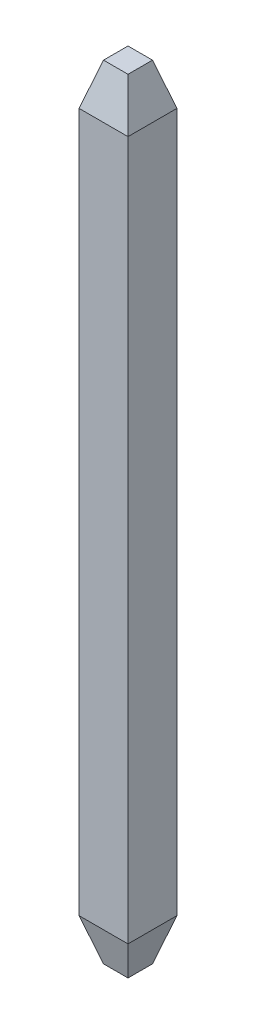
ISO-10303-21;
HEADER;
FILE_DESCRIPTION(('STEP AP214'),'2;1');
FILE_NAME('part.step','',(''),(''),'','','');
FILE_SCHEMA(('AUTOMOTIVE_DESIGN { 1 0 10303 214 1 1 1 1 }'));
ENDSEC;
DATA;
#1=APPLICATION_CONTEXT('core data for automotive mechanical design processes');
#2=APPLICATION_PROTOCOL_DEFINITION('international standard','automotive_design',2000,#1);
#3=PRODUCT_CONTEXT('',#1,'mechanical');
#4=PRODUCT('Part','Part','',(#3));
#5=PRODUCT_RELATED_PRODUCT_CATEGORY('part','',(#4));
#6=PRODUCT_DEFINITION_FORMATION('','',#4);
#7=PRODUCT_DEFINITION_CONTEXT('part definition',#1,'design');
#8=PRODUCT_DEFINITION('design','',#6,#7);
#9=PRODUCT_DEFINITION_SHAPE('','',#8);
#10=(LENGTH_UNIT() NAMED_UNIT(*) SI_UNIT(.MILLI.,.METRE.));
#11=(NAMED_UNIT(*) PLANE_ANGLE_UNIT() SI_UNIT($,.RADIAN.));
#12=(NAMED_UNIT(*) SI_UNIT($,.STERADIAN.) SOLID_ANGLE_UNIT());
#13=UNCERTAINTY_MEASURE_WITH_UNIT(LENGTH_MEASURE(1.E-05),#10,'distance_accuracy_value','');
#14=(GEOMETRIC_REPRESENTATION_CONTEXT(3) GLOBAL_UNCERTAINTY_ASSIGNED_CONTEXT((#13)) GLOBAL_UNIT_ASSIGNED_CONTEXT((#10,
#11,#12)) REPRESENTATION_CONTEXT('',''));
#15=CARTESIAN_POINT('',(0.,0.,0.));
#16=DIRECTION('',(0.,0.,1.));
#17=DIRECTION('',(1.,0.,0.));
#18=AXIS2_PLACEMENT_3D('',#15,#16,#17);
#19=CARTESIAN_POINT('',(-11.589999999987,-5.53543505344795,-19.1989999999763));
#20=DIRECTION('',(-1.,0.,0.));
#21=DIRECTION('',(0.,0.,1.));
#22=AXIS2_PLACEMENT_3D('',#19,#20,#21);
#23=PLANE('',#22);
#24=DIRECTION('',(0.,1.,0.));
#25=VECTOR('',#24,1.);
#26=CARTESIAN_POINT('',(-11.589999999987,-10.1039999999832,-19.8399999999763));
#27=LINE('',#26,#25);
#28=CARTESIAN_POINT('',(-11.589999999987,-10.1039999999832,-19.8399999999763));
#29=VERTEX_POINT('',#28);
#30=CARTESIAN_POINT('',(-11.589999999987,-0.965870106912691,-19.8399999999763));
#31=VERTEX_POINT('',#30);
#32=EDGE_CURVE('E181',#29,#31,#27,.T.);
#33=ORIENTED_EDGE('',*,*,#32,.F.);
#34=DIRECTION('',(0.,0.,-1.));
#35=VECTOR('',#34,1.);
#36=CARTESIAN_POINT('',(-11.589999999987,-10.1039999999832,-19.1999999999763));
#37=LINE('',#36,#35);
#38=CARTESIAN_POINT('',(-11.589999999987,-10.1039999999832,-19.1999999999763));
#39=VERTEX_POINT('',#38);
#40=EDGE_CURVE('E42',#39,#29,#37,.T.);
#41=ORIENTED_EDGE('',*,*,#40,.F.);
#42=DIRECTION('',(0.,1.,0.));
#43=VECTOR('',#42,1.);
#44=CARTESIAN_POINT('',(-11.589999999987,-10.1039999999832,-19.1999999999763));
#45=LINE('',#44,#43);
#46=CARTESIAN_POINT('',(-11.589999999987,-0.965870106912691,-19.1999999999763));
#47=VERTEX_POINT('',#46);
#48=EDGE_CURVE('E11',#39,#47,#45,.T.);
#49=ORIENTED_EDGE('',*,*,#48,.T.);
#50=DIRECTION('',(0.,0.,-1.));
#51=VECTOR('',#50,1.);
#52=CARTESIAN_POINT('',(-11.589999999987,-0.965870106912693,-19.1999999999763));
#53=LINE('',#52,#51);
#54=EDGE_CURVE('E28',#47,#31,#53,.T.);
#55=ORIENTED_EDGE('',*,*,#54,.T.);
#56=EDGE_LOOP('',(#33,#41,#49,#55));
#57=FACE_BOUND('',#56,.T.);
#58=ADVANCED_FACE('F17',(#57),#23,.T.);
#59=CARTESIAN_POINT('',(-10.948999999987,-5.53443505344795,-19.8399999999763));
#60=DIRECTION('',(0.,0.,-1.));
#61=DIRECTION('',(0.,-1.,0.));
#62=AXIS2_PLACEMENT_3D('',#59,#60,#61);
#63=PLANE('',#62);
#64=DIRECTION('',(0.,1.,0.));
#65=VECTOR('',#64,1.);
#66=CARTESIAN_POINT('',(-10.949999999987,-10.1039999999832,-19.8399999999763));
#67=LINE('',#66,#65);
#68=CARTESIAN_POINT('',(-10.949999999987,-10.1039999999832,-19.8399999999763));
#69=VERTEX_POINT('',#68);
#70=CARTESIAN_POINT('',(-10.949999999987,-0.965870106912691,-19.8399999999763));
#71=VERTEX_POINT('',#70);
#72=EDGE_CURVE('E147',#69,#71,#67,.T.);
#73=ORIENTED_EDGE('',*,*,#72,.F.);
#74=DIRECTION('',(1.,0.,0.));
#75=VECTOR('',#74,1.);
#76=CARTESIAN_POINT('',(-11.589999999987,-10.1039999999832,-19.8399999999763));
#77=LINE('',#76,#75);
#78=EDGE_CURVE('E128',#29,#69,#77,.T.);
#79=ORIENTED_EDGE('',*,*,#78,.F.);
#80=ORIENTED_EDGE('',*,*,#32,.T.);
#81=DIRECTION('',(1.,0.,0.));
#82=VECTOR('',#81,1.);
#83=CARTESIAN_POINT('',(-11.589999999987,-0.965870106912693,-19.8399999999763));
#84=LINE('',#83,#82);
#85=EDGE_CURVE('E123',#31,#71,#84,.T.);
#86=ORIENTED_EDGE('',*,*,#85,.T.);
#87=EDGE_LOOP('',(#73,#79,#80,#86));
#88=FACE_BOUND('',#87,.T.);
#89=ADVANCED_FACE('F158',(#88),#63,.T.);
#90=CARTESIAN_POINT('',(-10.949999999987,-11.0738701069127,-19.5199999999763));
#91=DIRECTION('',(1.,0.,0.));
#92=DIRECTION('',(0.,1.,0.));
#93=AXIS2_PLACEMENT_3D('',#90,#91,#92);
#94=PLANE('',#93);
#95=DIRECTION('',(0.,1.,0.));
#96=VECTOR('',#95,1.);
#97=CARTESIAN_POINT('',(-10.949999999987,-10.1039999999832,-19.1999999999763));
#98=LINE('',#97,#96);
#99=CARTESIAN_POINT('',(-10.949999999987,-10.1039999999832,-19.1999999999763));
#100=VERTEX_POINT('',#99);
#101=CARTESIAN_POINT('',(-10.949999999987,-0.965870106912691,-19.1999999999763));
#102=VERTEX_POINT('',#101);
#103=EDGE_CURVE('E149',#100,#102,#98,.T.);
#104=ORIENTED_EDGE('',*,*,#103,.F.);
#105=DIRECTION('',(0.,0.,1.));
#106=VECTOR('',#105,1.);
#107=CARTESIAN_POINT('',(-10.949999999987,-10.1039999999832,-19.8399999999763));
#108=LINE('',#107,#106);
#109=EDGE_CURVE('E144',#69,#100,#108,.T.);
#110=ORIENTED_EDGE('',*,*,#109,.F.);
#111=ORIENTED_EDGE('',*,*,#72,.T.);
#112=DIRECTION('',(0.,0.,1.));
#113=VECTOR('',#112,1.);
#114=CARTESIAN_POINT('',(-10.949999999987,-0.965870106912693,-19.8399999999763));
#115=LINE('',#114,#113);
#116=EDGE_CURVE('E160',#71,#102,#115,.T.);
#117=ORIENTED_EDGE('',*,*,#116,.T.);
#118=EDGE_LOOP('',(#104,#110,#111,#117));
#119=FACE_BOUND('',#118,.T.);
#120=ADVANCED_FACE('F145',(#119),#94,.T.);
#121=CARTESIAN_POINT('',(-10.949999999987,-0.965870106912693,-19.5199999999763));
#122=DIRECTION('',(0.959644900900968,0.281214622974643,0.));
#123=DIRECTION('',(0.,0.,-1.));
#124=AXIS2_PLACEMENT_3D('',#121,#122,#123);
#125=PLANE('',#124);
#126=DIRECTION('',(-0.270714017147727,0.923811583516618,0.270714017147727));
#127=VECTOR('',#126,1.);
#128=CARTESIAN_POINT('',(-10.949999999987,-0.965870106912693,-19.8399999999763));
#129=LINE('',#128,#127);
#130=CARTESIAN_POINT('',(-11.109999999987,-0.419870106912692,-19.6799999999763));
#131=VERTEX_POINT('',#130);
#132=EDGE_CURVE('E197',#71,#131,#129,.T.);
#133=ORIENTED_EDGE('',*,*,#132,.T.);
#134=DIRECTION('',(0.,0.,1.));
#135=VECTOR('',#134,1.);
#136=CARTESIAN_POINT('',(-11.109999999987,-0.419870106912693,-19.6799999999763));
#137=LINE('',#136,#135);
#138=CARTESIAN_POINT('',(-11.109999999987,-0.419870106912692,-19.3599999999763));
#139=VERTEX_POINT('',#138);
#140=EDGE_CURVE('E201',#131,#139,#137,.T.);
#141=ORIENTED_EDGE('',*,*,#140,.T.);
#142=DIRECTION('',(-0.270714017147727,0.923811583516618,-0.270714017147727));
#143=VECTOR('',#142,1.);
#144=CARTESIAN_POINT('',(-10.949999999987,-0.965870106912693,-19.1999999999763));
#145=LINE('',#144,#143);
#146=EDGE_CURVE('E260',#102,#139,#145,.T.);
#147=ORIENTED_EDGE('',*,*,#146,.F.);
#148=ORIENTED_EDGE('',*,*,#116,.F.);
#149=EDGE_LOOP('',(#133,#141,#147,#148));
#150=FACE_BOUND('',#149,.T.);
#151=ADVANCED_FACE('F19',(#150),#125,.T.);
#152=CARTESIAN_POINT('',(-11.269999999987,-0.965870106912693,-19.1999999999763));
#153=DIRECTION('',(0.,0.281214622974643,0.959644900900968));
#154=DIRECTION('',(1.,0.,0.));
#155=AXIS2_PLACEMENT_3D('',#152,#153,#154);
#156=PLANE('',#155);
#157=ORIENTED_EDGE('',*,*,#146,.T.);
#158=DIRECTION('',(-1.,0.,0.));
#159=VECTOR('',#158,1.);
#160=CARTESIAN_POINT('',(-11.109999999987,-0.419870106912693,-19.3599999999763));
#161=LINE('',#160,#159);
#162=CARTESIAN_POINT('',(-11.429999999987,-0.419870106912692,-19.3599999999763));
#163=VERTEX_POINT('',#162);
#164=EDGE_CURVE('E155',#139,#163,#161,.T.);
#165=ORIENTED_EDGE('',*,*,#164,.T.);
#166=DIRECTION('',(0.270714017147727,0.923811583516618,-0.270714017147727));
#167=VECTOR('',#166,1.);
#168=CARTESIAN_POINT('',(-11.589999999987,-0.965870106912693,-19.1999999999763));
#169=LINE('',#168,#167);
#170=EDGE_CURVE('E66',#47,#163,#169,.T.);
#171=ORIENTED_EDGE('',*,*,#170,.F.);
#172=DIRECTION('',(-1.,0.,0.));
#173=VECTOR('',#172,1.);
#174=CARTESIAN_POINT('',(-10.949999999987,-0.965870106912693,-19.1999999999763));
#175=LINE('',#174,#173);
#176=EDGE_CURVE('E265',#102,#47,#175,.T.);
#177=ORIENTED_EDGE('',*,*,#176,.F.);
#178=EDGE_LOOP('',(#157,#165,#171,#177));
#179=FACE_BOUND('',#178,.T.);
#180=ADVANCED_FACE('F241',(#179),#156,.T.);
#181=CARTESIAN_POINT('',(-11.269999999987,-0.419870106912693,-19.6809999999763));
#182=DIRECTION('',(0.,1.,0.));
#183=DIRECTION('',(1.,0.,0.));
#184=AXIS2_PLACEMENT_3D('',#181,#182,#183);
#185=PLANE('',#184);
#186=DIRECTION('',(1.,0.,0.));
#187=VECTOR('',#186,1.);
#188=CARTESIAN_POINT('',(-11.429999999987,-0.419870106912693,-19.6799999999763));
#189=LINE('',#188,#187);
#190=CARTESIAN_POINT('',(-11.429999999987,-0.419870106912692,-19.6799999999763));
#191=VERTEX_POINT('',#190);
#192=EDGE_CURVE('E139',#191,#131,#189,.T.);
#193=ORIENTED_EDGE('',*,*,#192,.F.);
#194=DIRECTION('',(0.,0.,-1.));
#195=VECTOR('',#194,1.);
#196=CARTESIAN_POINT('',(-11.429999999987,-0.419870106912693,-19.3599999999763));
#197=LINE('',#196,#195);
#198=EDGE_CURVE('E78',#163,#191,#197,.T.);
#199=ORIENTED_EDGE('',*,*,#198,.F.);
#200=ORIENTED_EDGE('',*,*,#164,.F.);
#201=ORIENTED_EDGE('',*,*,#140,.F.);
#202=EDGE_LOOP('',(#193,#199,#200,#201));
#203=FACE_BOUND('',#202,.T.);
#204=ADVANCED_FACE('F247',(#203),#185,.T.);
#205=CARTESIAN_POINT('',(-10.949999999987,-10.1039999999832,-19.5199999999763));
#206=DIRECTION('',(0.959644900900968,-0.281214622974643,0.));
#207=DIRECTION('',(0.,0.,-1.));
#208=AXIS2_PLACEMENT_3D('',#205,#206,#207);
#209=PLANE('',#208);
#210=ORIENTED_EDGE('',*,*,#109,.T.);
#211=DIRECTION('',(-0.270714017147727,-0.923811583516618,-0.270714017147727));
#212=VECTOR('',#211,1.);
#213=CARTESIAN_POINT('',(-10.949999999987,-10.1039999999832,-19.1999999999763));
#214=LINE('',#213,#212);
#215=CARTESIAN_POINT('',(-11.109999999987,-10.6499999999832,-19.3599999999763));
#216=VERTEX_POINT('',#215);
#217=EDGE_CURVE('E156',#100,#216,#214,.T.);
#218=ORIENTED_EDGE('',*,*,#217,.T.);
#219=DIRECTION('',(0.,0.,1.));
#220=VECTOR('',#219,1.);
#221=CARTESIAN_POINT('',(-11.109999999987,-10.6499999999832,-19.6799999999763));
#222=LINE('',#221,#220);
#223=CARTESIAN_POINT('',(-11.109999999987,-10.6499999999832,-19.6799999999763));
#224=VERTEX_POINT('',#223);
#225=EDGE_CURVE('E21',#224,#216,#222,.T.);
#226=ORIENTED_EDGE('',*,*,#225,.F.);
#227=DIRECTION('',(-0.270714017147727,-0.923811583516618,0.270714017147727));
#228=VECTOR('',#227,1.);
#229=CARTESIAN_POINT('',(-10.949999999987,-10.1039999999832,-19.8399999999763));
#230=LINE('',#229,#228);
#231=EDGE_CURVE('E132',#69,#224,#230,.T.);
#232=ORIENTED_EDGE('',*,*,#231,.F.);
#233=EDGE_LOOP('',(#210,#218,#226,#232));
#234=FACE_BOUND('',#233,.T.);
#235=ADVANCED_FACE('F162',(#234),#209,.T.);
#236=CARTESIAN_POINT('',(-11.430999999987,-10.6499999999832,-19.5199999999763));
#237=DIRECTION('',(0.,-1.,0.));
#238=DIRECTION('',(0.,0.,-1.));
#239=AXIS2_PLACEMENT_3D('',#236,#237,#238);
#240=PLANE('',#239);
#241=ORIENTED_EDGE('',*,*,#225,.T.);
#242=DIRECTION('',(-1.,0.,0.));
#243=VECTOR('',#242,1.);
#244=CARTESIAN_POINT('',(-11.109999999987,-10.6499999999832,-19.3599999999763));
#245=LINE('',#244,#243);
#246=CARTESIAN_POINT('',(-11.429999999987,-10.6499999999832,-19.3599999999763));
#247=VERTEX_POINT('',#246);
#248=EDGE_CURVE('E195',#216,#247,#245,.T.);
#249=ORIENTED_EDGE('',*,*,#248,.T.);
#250=DIRECTION('',(0.,0.,-1.));
#251=VECTOR('',#250,1.);
#252=CARTESIAN_POINT('',(-11.429999999987,-10.6499999999832,-19.3599999999763));
#253=LINE('',#252,#251);
#254=CARTESIAN_POINT('',(-11.429999999987,-10.6499999999832,-19.6799999999763));
#255=VERTEX_POINT('',#254);
#256=EDGE_CURVE('E97',#247,#255,#253,.T.);
#257=ORIENTED_EDGE('',*,*,#256,.T.);
#258=DIRECTION('',(1.,0.,0.));
#259=VECTOR('',#258,1.);
#260=CARTESIAN_POINT('',(-11.429999999987,-10.6499999999832,-19.6799999999763));
#261=LINE('',#260,#259);
#262=EDGE_CURVE('E90',#255,#224,#261,.T.);
#263=ORIENTED_EDGE('',*,*,#262,.T.);
#264=EDGE_LOOP('',(#241,#249,#257,#263));
#265=FACE_BOUND('',#264,.T.);
#266=ADVANCED_FACE('F280',(#265),#240,.T.);
#267=CARTESIAN_POINT('',(-11.269999999987,-10.1039999999832,-19.1999999999763));
#268=DIRECTION('',(0.,-0.281214622974643,0.959644900900968));
#269=DIRECTION('',(-1.,0.,0.));
#270=AXIS2_PLACEMENT_3D('',#267,#268,#269);
#271=PLANE('',#270);
#272=DIRECTION('',(-1.,0.,0.));
#273=VECTOR('',#272,1.);
#274=CARTESIAN_POINT('',(-10.949999999987,-10.1039999999832,-19.1999999999763));
#275=LINE('',#274,#273);
#276=EDGE_CURVE('E173',#100,#39,#275,.T.);
#277=ORIENTED_EDGE('',*,*,#276,.T.);
#278=DIRECTION('',(0.270714017147727,-0.923811583516618,-0.270714017147727));
#279=VECTOR('',#278,1.);
#280=CARTESIAN_POINT('',(-11.589999999987,-10.1039999999832,-19.1999999999763));
#281=LINE('',#280,#279);
#282=EDGE_CURVE('E176',#39,#247,#281,.T.);
#283=ORIENTED_EDGE('',*,*,#282,.T.);
#284=ORIENTED_EDGE('',*,*,#248,.F.);
#285=ORIENTED_EDGE('',*,*,#217,.F.);
#286=EDGE_LOOP('',(#277,#283,#284,#285));
#287=FACE_BOUND('',#286,.T.);
#288=ADVANCED_FACE('F209',(#287),#271,.T.);
#289=CARTESIAN_POINT('',(-11.269999999987,-0.965870106912693,-19.8399999999763));
#290=DIRECTION('',(0.,0.281214622974643,-0.959644900900968));
#291=DIRECTION('',(-1.,0.,0.));
#292=AXIS2_PLACEMENT_3D('',#289,#290,#291);
#293=PLANE('',#292);
#294=DIRECTION('',(0.270714017147727,0.923811583516618,0.270714017147727));
#295=VECTOR('',#294,1.);
#296=CARTESIAN_POINT('',(-11.589999999987,-0.965870106912693,-19.8399999999763));
#297=LINE('',#296,#295);
#298=EDGE_CURVE('E178',#31,#191,#297,.T.);
#299=ORIENTED_EDGE('',*,*,#298,.T.);
#300=ORIENTED_EDGE('',*,*,#192,.T.);
#301=ORIENTED_EDGE('',*,*,#132,.F.);
#302=ORIENTED_EDGE('',*,*,#85,.F.);
#303=EDGE_LOOP('',(#299,#300,#301,#302));
#304=FACE_BOUND('',#303,.T.);
#305=ADVANCED_FACE('F252',(#304),#293,.T.);
#306=CARTESIAN_POINT('',(-11.269999999987,-10.1039999999832,-19.8399999999763));
#307=DIRECTION('',(0.,-0.281214622974643,-0.959644900900968));
#308=DIRECTION('',(0.,-0.959644900900968,0.281214622974643));
#309=AXIS2_PLACEMENT_3D('',#306,#307,#308);
#310=PLANE('',#309);
#311=ORIENTED_EDGE('',*,*,#78,.T.);
#312=ORIENTED_EDGE('',*,*,#231,.T.);
#313=ORIENTED_EDGE('',*,*,#262,.F.);
#314=DIRECTION('',(0.270714017147727,-0.923811583516618,0.270714017147727));
#315=VECTOR('',#314,1.);
#316=CARTESIAN_POINT('',(-11.589999999987,-10.1039999999832,-19.8399999999763));
#317=LINE('',#316,#315);
#318=EDGE_CURVE('E134',#29,#255,#317,.T.);
#319=ORIENTED_EDGE('',*,*,#318,.F.);
#320=EDGE_LOOP('',(#311,#312,#313,#319));
#321=FACE_BOUND('',#320,.T.);
#322=ADVANCED_FACE('F130',(#321),#310,.T.);
#323=CARTESIAN_POINT('',(-11.589999999987,-0.965870106912693,-19.5199999999763));
#324=DIRECTION('',(-0.959644900900968,0.281214622974643,0.));
#325=DIRECTION('',(0.,0.,1.));
#326=AXIS2_PLACEMENT_3D('',#323,#324,#325);
#327=PLANE('',#326);
#328=ORIENTED_EDGE('',*,*,#170,.T.);
#329=ORIENTED_EDGE('',*,*,#198,.T.);
#330=ORIENTED_EDGE('',*,*,#298,.F.);
#331=ORIENTED_EDGE('',*,*,#54,.F.);
#332=EDGE_LOOP('',(#328,#329,#330,#331));
#333=FACE_BOUND('',#332,.T.);
#334=ADVANCED_FACE('F220',(#333),#327,.T.);
#335=CARTESIAN_POINT('',(-11.590999999987,-5.53543505344795,-19.1999999999763));
#336=DIRECTION('',(0.,0.,1.));
#337=DIRECTION('',(1.,0.,0.));
#338=AXIS2_PLACEMENT_3D('',#335,#336,#337);
#339=PLANE('',#338);
#340=ORIENTED_EDGE('',*,*,#48,.F.);
#341=ORIENTED_EDGE('',*,*,#276,.F.);
#342=ORIENTED_EDGE('',*,*,#103,.T.);
#343=ORIENTED_EDGE('',*,*,#176,.T.);
#344=EDGE_LOOP('',(#340,#341,#342,#343));
#345=FACE_BOUND('',#344,.T.);
#346=ADVANCED_FACE('F213',(#345),#339,.T.);
#347=CARTESIAN_POINT('',(-11.589999999987,-10.1039999999832,-19.5199999999763));
#348=DIRECTION('',(-0.959644900900968,-0.281214622974643,0.));
#349=DIRECTION('',(-0.281214622974643,0.959644900900968,0.));
#350=AXIS2_PLACEMENT_3D('',#347,#348,#349);
#351=PLANE('',#350);
#352=ORIENTED_EDGE('',*,*,#40,.T.);
#353=ORIENTED_EDGE('',*,*,#318,.T.);
#354=ORIENTED_EDGE('',*,*,#256,.F.);
#355=ORIENTED_EDGE('',*,*,#282,.F.);
#356=EDGE_LOOP('',(#352,#353,#354,#355));
#357=FACE_BOUND('',#356,.T.);
#358=ADVANCED_FACE('F211',(#357),#351,.T.);
#359=CLOSED_SHELL('',(#58,#89,#120,#151,#180,#204,#235,#266,#288,#305,#322,#334,#346,#358));
#360=MANIFOLD_SOLID_BREP('B1',#359);
#361=ADVANCED_BREP_SHAPE_REPRESENTATION('',(#18,#360),#14);
#362=SHAPE_DEFINITION_REPRESENTATION(#9,#361);
ENDSEC;
END-ISO-10303-21;
